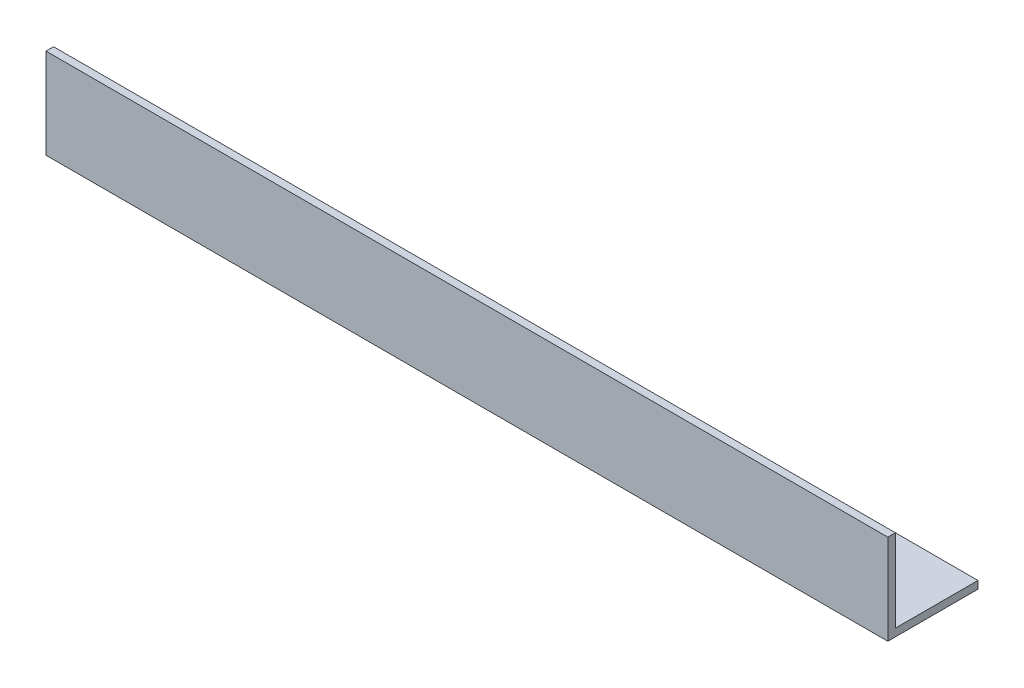
ISO-10303-21;
HEADER;
FILE_DESCRIPTION(('STEP AP214'),'2;1');
FILE_NAME('part.step','',(''),(''),'','','');
FILE_SCHEMA(('AUTOMOTIVE_DESIGN { 1 0 10303 214 1 1 1 1 }'));
ENDSEC;
DATA;
#1=APPLICATION_CONTEXT('core data for automotive mechanical design processes');
#2=APPLICATION_PROTOCOL_DEFINITION('international standard','automotive_design',2000,#1);
#3=PRODUCT_CONTEXT('',#1,'mechanical');
#4=PRODUCT('Part','Part','',(#3));
#5=PRODUCT_RELATED_PRODUCT_CATEGORY('part','',(#4));
#6=PRODUCT_DEFINITION_FORMATION('','',#4);
#7=PRODUCT_DEFINITION_CONTEXT('part definition',#1,'design');
#8=PRODUCT_DEFINITION('design','',#6,#7);
#9=PRODUCT_DEFINITION_SHAPE('','',#8);
#10=(LENGTH_UNIT() NAMED_UNIT(*) SI_UNIT(.MILLI.,.METRE.));
#11=(NAMED_UNIT(*) PLANE_ANGLE_UNIT() SI_UNIT($,.RADIAN.));
#12=(NAMED_UNIT(*) SI_UNIT($,.STERADIAN.) SOLID_ANGLE_UNIT());
#13=UNCERTAINTY_MEASURE_WITH_UNIT(LENGTH_MEASURE(1.E-05),#10,'distance_accuracy_value','');
#14=(GEOMETRIC_REPRESENTATION_CONTEXT(3) GLOBAL_UNCERTAINTY_ASSIGNED_CONTEXT((#13)) GLOBAL_UNIT_ASSIGNED_CONTEXT((#10,
#11,#12)) REPRESENTATION_CONTEXT('',''));
#15=CARTESIAN_POINT('',(0.,0.,0.));
#16=DIRECTION('',(0.,0.,1.));
#17=DIRECTION('',(1.,0.,0.));
#18=AXIS2_PLACEMENT_3D('',#15,#16,#17);
#19=CARTESIAN_POINT('',(177.8,0.,-19.05));
#20=DIRECTION('',(0.,1.,0.));
#21=DIRECTION('',(0.,0.,1.));
#22=AXIS2_PLACEMENT_3D('',#19,#20,#21);
#23=PLANE('',#22);
#24=DIRECTION('',(0.,0.,-1.));
#25=VECTOR('',#24,1.);
#26=CARTESIAN_POINT('',(0.,0.,-19.05));
#27=LINE('',#26,#25);
#28=CARTESIAN_POINT('',(0.,0.,0.));
#29=VERTEX_POINT('',#28);
#30=CARTESIAN_POINT('',(0.,0.,-19.05));
#31=VERTEX_POINT('',#30);
#32=EDGE_CURVE('E119',#29,#31,#27,.T.);
#33=ORIENTED_EDGE('',*,*,#32,.T.);
#34=DIRECTION('',(-1.,0.,0.));
#35=VECTOR('',#34,1.);
#36=CARTESIAN_POINT('',(177.8,0.,-19.05));
#37=LINE('',#36,#35);
#38=CARTESIAN_POINT('',(177.8,0.,-19.05));
#39=VERTEX_POINT('',#38);
#40=EDGE_CURVE('E11',#39,#31,#37,.T.);
#41=ORIENTED_EDGE('',*,*,#40,.F.);
#42=DIRECTION('',(0.,0.,-1.));
#43=VECTOR('',#42,1.);
#44=CARTESIAN_POINT('',(177.8,0.,-19.05));
#45=LINE('',#44,#43);
#46=CARTESIAN_POINT('',(177.8,0.,0.));
#47=VERTEX_POINT('',#46);
#48=EDGE_CURVE('E129',#47,#39,#45,.T.);
#49=ORIENTED_EDGE('',*,*,#48,.F.);
#50=DIRECTION('',(-1.,0.,0.));
#51=VECTOR('',#50,1.);
#52=CARTESIAN_POINT('',(177.8,0.,0.));
#53=LINE('',#52,#51);
#54=EDGE_CURVE('E115',#47,#29,#53,.T.);
#55=ORIENTED_EDGE('',*,*,#54,.T.);
#56=EDGE_LOOP('',(#33,#41,#49,#55));
#57=FACE_BOUND('',#56,.T.);
#58=ADVANCED_FACE('F35',(#57),#23,.F.);
#59=CARTESIAN_POINT('',(177.8,1.6002,-19.05));
#60=DIRECTION('',(0.,0.,1.));
#61=DIRECTION('',(1.,0.,0.));
#62=AXIS2_PLACEMENT_3D('',#59,#60,#61);
#63=PLANE('',#62);
#64=DIRECTION('',(0.,1.,0.));
#65=VECTOR('',#64,1.);
#66=CARTESIAN_POINT('',(0.,1.6002,-19.05));
#67=LINE('',#66,#65);
#68=CARTESIAN_POINT('',(0.,1.6002,-19.05));
#69=VERTEX_POINT('',#68);
#70=EDGE_CURVE('E122',#31,#69,#67,.T.);
#71=ORIENTED_EDGE('',*,*,#70,.T.);
#72=DIRECTION('',(-1.,0.,0.));
#73=VECTOR('',#72,1.);
#74=CARTESIAN_POINT('',(177.8,1.6002,-19.05));
#75=LINE('',#74,#73);
#76=CARTESIAN_POINT('',(177.8,1.6002,-19.05));
#77=VERTEX_POINT('',#76);
#78=EDGE_CURVE('E43',#77,#69,#75,.T.);
#79=ORIENTED_EDGE('',*,*,#78,.F.);
#80=DIRECTION('',(0.,1.,0.));
#81=VECTOR('',#80,1.);
#82=CARTESIAN_POINT('',(177.8,1.6002,-19.05));
#83=LINE('',#82,#81);
#84=EDGE_CURVE('E88',#39,#77,#83,.T.);
#85=ORIENTED_EDGE('',*,*,#84,.F.);
#86=ORIENTED_EDGE('',*,*,#40,.T.);
#87=EDGE_LOOP('',(#71,#79,#85,#86));
#88=FACE_BOUND('',#87,.T.);
#89=ADVANCED_FACE('F153',(#88),#63,.F.);
#90=CARTESIAN_POINT('',(177.8,1.6002,-1.6002));
#91=DIRECTION('',(0.,-1.,0.));
#92=DIRECTION('',(0.,0.,-1.));
#93=AXIS2_PLACEMENT_3D('',#90,#91,#92);
#94=PLANE('',#93);
#95=DIRECTION('',(0.,0.,1.));
#96=VECTOR('',#95,1.);
#97=CARTESIAN_POINT('',(0.,1.6002,-1.6002));
#98=LINE('',#97,#96);
#99=CARTESIAN_POINT('',(0.,1.6002,-1.6002));
#100=VERTEX_POINT('',#99);
#101=EDGE_CURVE('E124',#69,#100,#98,.T.);
#102=ORIENTED_EDGE('',*,*,#101,.T.);
#103=DIRECTION('',(-1.,0.,0.));
#104=VECTOR('',#103,1.);
#105=CARTESIAN_POINT('',(177.8,1.6002,-1.6002));
#106=LINE('',#105,#104);
#107=CARTESIAN_POINT('',(177.8,1.6002,-1.6002));
#108=VERTEX_POINT('',#107);
#109=EDGE_CURVE('E110',#108,#100,#106,.T.);
#110=ORIENTED_EDGE('',*,*,#109,.F.);
#111=DIRECTION('',(0.,0.,1.));
#112=VECTOR('',#111,1.);
#113=CARTESIAN_POINT('',(177.8,1.6002,-1.6002));
#114=LINE('',#113,#112);
#115=EDGE_CURVE('E101',#77,#108,#114,.T.);
#116=ORIENTED_EDGE('',*,*,#115,.F.);
#117=ORIENTED_EDGE('',*,*,#78,.T.);
#118=EDGE_LOOP('',(#102,#110,#116,#117));
#119=FACE_BOUND('',#118,.T.);
#120=ADVANCED_FACE('F135',(#119),#94,.F.);
#121=CARTESIAN_POINT('',(177.8,19.05,-1.6002));
#122=DIRECTION('',(0.,0.,1.));
#123=DIRECTION('',(0.,-1.,0.));
#124=AXIS2_PLACEMENT_3D('',#121,#122,#123);
#125=PLANE('',#124);
#126=DIRECTION('',(0.,1.,0.));
#127=VECTOR('',#126,1.);
#128=CARTESIAN_POINT('',(0.,19.05,-1.6002));
#129=LINE('',#128,#127);
#130=CARTESIAN_POINT('',(0.,19.05,-1.6002));
#131=VERTEX_POINT('',#130);
#132=EDGE_CURVE('E109',#100,#131,#129,.T.);
#133=ORIENTED_EDGE('',*,*,#132,.T.);
#134=DIRECTION('',(-1.,0.,0.));
#135=VECTOR('',#134,1.);
#136=CARTESIAN_POINT('',(177.8,19.05,-1.6002));
#137=LINE('',#136,#135);
#138=CARTESIAN_POINT('',(177.8,19.05,-1.6002));
#139=VERTEX_POINT('',#138);
#140=EDGE_CURVE('E106',#139,#131,#137,.T.);
#141=ORIENTED_EDGE('',*,*,#140,.F.);
#142=DIRECTION('',(0.,1.,0.));
#143=VECTOR('',#142,1.);
#144=CARTESIAN_POINT('',(177.8,19.05,-1.6002));
#145=LINE('',#144,#143);
#146=EDGE_CURVE('E95',#108,#139,#145,.T.);
#147=ORIENTED_EDGE('',*,*,#146,.F.);
#148=ORIENTED_EDGE('',*,*,#109,.T.);
#149=EDGE_LOOP('',(#133,#141,#147,#148));
#150=FACE_BOUND('',#149,.T.);
#151=ADVANCED_FACE('F107',(#150),#125,.F.);
#152=CARTESIAN_POINT('',(177.8,19.05,0.));
#153=DIRECTION('',(0.,-1.,0.));
#154=DIRECTION('',(0.,0.,-1.));
#155=AXIS2_PLACEMENT_3D('',#152,#153,#154);
#156=PLANE('',#155);
#157=DIRECTION('',(0.,0.,1.));
#158=VECTOR('',#157,1.);
#159=CARTESIAN_POINT('',(0.,19.05,0.));
#160=LINE('',#159,#158);
#161=CARTESIAN_POINT('',(0.,19.05,0.));
#162=VERTEX_POINT('',#161);
#163=EDGE_CURVE('E74',#131,#162,#160,.T.);
#164=ORIENTED_EDGE('',*,*,#163,.T.);
#165=DIRECTION('',(-1.,0.,0.));
#166=VECTOR('',#165,1.);
#167=CARTESIAN_POINT('',(177.8,19.05,0.));
#168=LINE('',#167,#166);
#169=CARTESIAN_POINT('',(177.8,19.05,0.));
#170=VERTEX_POINT('',#169);
#171=EDGE_CURVE('E111',#170,#162,#168,.T.);
#172=ORIENTED_EDGE('',*,*,#171,.F.);
#173=DIRECTION('',(0.,0.,1.));
#174=VECTOR('',#173,1.);
#175=CARTESIAN_POINT('',(177.8,19.05,0.));
#176=LINE('',#175,#174);
#177=EDGE_CURVE('E99',#139,#170,#176,.T.);
#178=ORIENTED_EDGE('',*,*,#177,.F.);
#179=ORIENTED_EDGE('',*,*,#140,.T.);
#180=EDGE_LOOP('',(#164,#172,#178,#179));
#181=FACE_BOUND('',#180,.T.);
#182=ADVANCED_FACE('F113',(#181),#156,.F.);
#183=CARTESIAN_POINT('',(177.8,0.,0.));
#184=DIRECTION('',(0.,0.,-1.));
#185=DIRECTION('',(-1.,0.,0.));
#186=AXIS2_PLACEMENT_3D('',#183,#184,#185);
#187=PLANE('',#186);
#188=DIRECTION('',(0.,-1.,0.));
#189=VECTOR('',#188,1.);
#190=CARTESIAN_POINT('',(0.,0.,0.));
#191=LINE('',#190,#189);
#192=EDGE_CURVE('E80',#162,#29,#191,.T.);
#193=ORIENTED_EDGE('',*,*,#192,.T.);
#194=ORIENTED_EDGE('',*,*,#54,.F.);
#195=DIRECTION('',(0.,-1.,0.));
#196=VECTOR('',#195,1.);
#197=CARTESIAN_POINT('',(177.8,0.,0.));
#198=LINE('',#197,#196);
#199=EDGE_CURVE('E51',#170,#47,#198,.T.);
#200=ORIENTED_EDGE('',*,*,#199,.F.);
#201=ORIENTED_EDGE('',*,*,#171,.T.);
#202=EDGE_LOOP('',(#193,#194,#200,#201));
#203=FACE_BOUND('',#202,.T.);
#204=ADVANCED_FACE('F142',(#203),#187,.F.);
#205=CARTESIAN_POINT('',(177.8,0.,0.));
#206=DIRECTION('',(-1.,0.,0.));
#207=DIRECTION('',(0.,0.,1.));
#208=AXIS2_PLACEMENT_3D('',#205,#206,#207);
#209=PLANE('',#208);
#210=ORIENTED_EDGE('',*,*,#48,.T.);
#211=ORIENTED_EDGE('',*,*,#84,.T.);
#212=ORIENTED_EDGE('',*,*,#115,.T.);
#213=ORIENTED_EDGE('',*,*,#146,.T.);
#214=ORIENTED_EDGE('',*,*,#177,.T.);
#215=ORIENTED_EDGE('',*,*,#199,.T.);
#216=EDGE_LOOP('',(#210,#211,#212,#213,#214,#215));
#217=FACE_BOUND('',#216,.T.);
#218=ADVANCED_FACE('F97',(#217),#209,.F.);
#219=CARTESIAN_POINT('',(0.,0.,0.));
#220=DIRECTION('',(-1.,0.,0.));
#221=DIRECTION('',(0.,0.,1.));
#222=AXIS2_PLACEMENT_3D('',#219,#220,#221);
#223=PLANE('',#222);
#224=ORIENTED_EDGE('',*,*,#32,.F.);
#225=ORIENTED_EDGE('',*,*,#192,.F.);
#226=ORIENTED_EDGE('',*,*,#163,.F.);
#227=ORIENTED_EDGE('',*,*,#132,.F.);
#228=ORIENTED_EDGE('',*,*,#101,.F.);
#229=ORIENTED_EDGE('',*,*,#70,.F.);
#230=EDGE_LOOP('',(#224,#225,#226,#227,#228,#229));
#231=FACE_BOUND('',#230,.T.);
#232=ADVANCED_FACE('F138',(#231),#223,.T.);
#233=CLOSED_SHELL('',(#58,#89,#120,#151,#182,#204,#218,#232));
#234=MANIFOLD_SOLID_BREP('B2',#233);
#235=ADVANCED_BREP_SHAPE_REPRESENTATION('',(#18,#234),#14);
#236=SHAPE_DEFINITION_REPRESENTATION(#9,#235);
ENDSEC;
END-ISO-10303-21;
